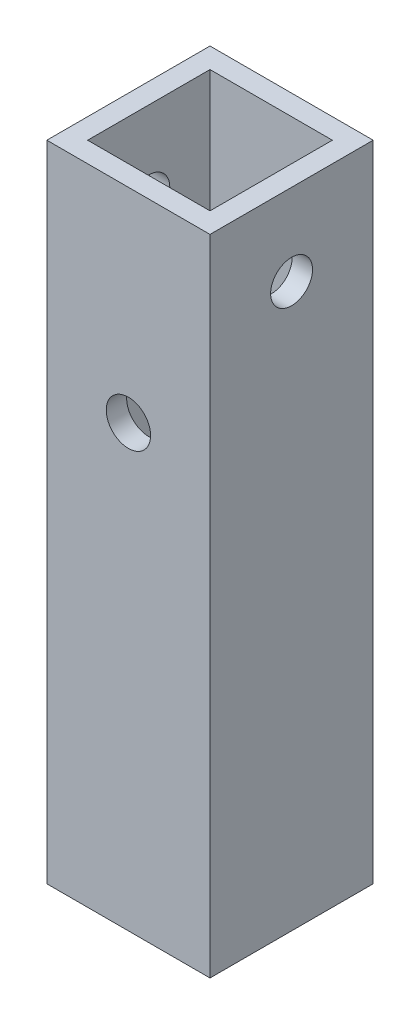
ISO-10303-21;
HEADER;
FILE_DESCRIPTION(('STEP AP214'),'2;1');
FILE_NAME('part.step','',(''),(''),'','','');
FILE_SCHEMA(('AUTOMOTIVE_DESIGN { 1 0 10303 214 1 1 1 1 }'));
ENDSEC;
DATA;
#1=APPLICATION_CONTEXT('core data for automotive mechanical design processes');
#2=APPLICATION_PROTOCOL_DEFINITION('international standard','automotive_design',2000,#1);
#3=PRODUCT_CONTEXT('',#1,'mechanical');
#4=PRODUCT('Part','Part','',(#3));
#5=PRODUCT_RELATED_PRODUCT_CATEGORY('part','',(#4));
#6=PRODUCT_DEFINITION_FORMATION('','',#4);
#7=PRODUCT_DEFINITION_CONTEXT('part definition',#1,'design');
#8=PRODUCT_DEFINITION('design','',#6,#7);
#9=PRODUCT_DEFINITION_SHAPE('','',#8);
#10=(LENGTH_UNIT() NAMED_UNIT(*) SI_UNIT(.MILLI.,.METRE.));
#11=(NAMED_UNIT(*) PLANE_ANGLE_UNIT() SI_UNIT($,.RADIAN.));
#12=(NAMED_UNIT(*) SI_UNIT($,.STERADIAN.) SOLID_ANGLE_UNIT());
#13=UNCERTAINTY_MEASURE_WITH_UNIT(LENGTH_MEASURE(1.E-05),#10,'distance_accuracy_value','');
#14=(GEOMETRIC_REPRESENTATION_CONTEXT(3) GLOBAL_UNCERTAINTY_ASSIGNED_CONTEXT((#13)) GLOBAL_UNIT_ASSIGNED_CONTEXT((#10,
#11,#12)) REPRESENTATION_CONTEXT('',''));
#15=CARTESIAN_POINT('',(0.,0.,0.));
#16=DIRECTION('',(0.,0.,1.));
#17=DIRECTION('',(1.,0.,0.));
#18=AXIS2_PLACEMENT_3D('',#15,#16,#17);
#19=CARTESIAN_POINT('',(0.,100.2538,0.));
#20=DIRECTION('',(0.,1.,0.));
#21=DIRECTION('',(0.,0.,1.));
#22=AXIS2_PLACEMENT_3D('',#19,#20,#21);
#23=PLANE('',#22);
#24=DIRECTION('',(0.,0.,1.));
#25=VECTOR('',#24,1.);
#26=CARTESIAN_POINT('',(-12.7,100.2538,12.7));
#27=LINE('',#26,#25);
#28=CARTESIAN_POINT('',(-12.7,100.2538,-12.7));
#29=VERTEX_POINT('',#28);
#30=CARTESIAN_POINT('',(-12.7,100.2538,12.7));
#31=VERTEX_POINT('',#30);
#32=EDGE_CURVE('E138',#29,#31,#27,.T.);
#33=ORIENTED_EDGE('',*,*,#32,.T.);
#34=DIRECTION('',(1.,0.,0.));
#35=VECTOR('',#34,1.);
#36=CARTESIAN_POINT('',(12.7,100.2538,12.7));
#37=LINE('',#36,#35);
#38=CARTESIAN_POINT('',(12.7,100.2538,12.7));
#39=VERTEX_POINT('',#38);
#40=EDGE_CURVE('E141',#31,#39,#37,.T.);
#41=ORIENTED_EDGE('',*,*,#40,.T.);
#42=DIRECTION('',(0.,0.,-1.));
#43=VECTOR('',#42,1.);
#44=CARTESIAN_POINT('',(12.7,100.2538,12.7));
#45=LINE('',#44,#43);
#46=CARTESIAN_POINT('',(12.7,100.2538,-12.7));
#47=VERTEX_POINT('',#46);
#48=EDGE_CURVE('E144',#39,#47,#45,.T.);
#49=ORIENTED_EDGE('',*,*,#48,.T.);
#50=DIRECTION('',(-1.,0.,0.));
#51=VECTOR('',#50,1.);
#52=CARTESIAN_POINT('',(12.7,100.2538,-12.7));
#53=LINE('',#52,#51);
#54=EDGE_CURVE('E146',#47,#29,#53,.T.);
#55=ORIENTED_EDGE('',*,*,#54,.T.);
#56=EDGE_LOOP('',(#33,#41,#49,#55));
#57=FACE_BOUND('',#56,.T.);
#58=DIRECTION('',(-1.,0.,0.));
#59=VECTOR('',#58,1.);
#60=CARTESIAN_POINT('',(9.525,100.2538,-9.525));
#61=LINE('',#60,#59);
#62=CARTESIAN_POINT('',(9.525,100.2538,-9.525));
#63=VERTEX_POINT('',#62);
#64=CARTESIAN_POINT('',(-9.525,100.2538,-9.525));
#65=VERTEX_POINT('',#64);
#66=EDGE_CURVE('E108',#63,#65,#61,.T.);
#67=ORIENTED_EDGE('',*,*,#66,.F.);
#68=DIRECTION('',(0.,0.,-1.));
#69=VECTOR('',#68,1.);
#70=CARTESIAN_POINT('',(9.525,100.2538,9.525));
#71=LINE('',#70,#69);
#72=CARTESIAN_POINT('',(9.525,100.2538,9.525));
#73=VERTEX_POINT('',#72);
#74=EDGE_CURVE('E100',#73,#63,#71,.T.);
#75=ORIENTED_EDGE('',*,*,#74,.F.);
#76=DIRECTION('',(1.,0.,0.));
#77=VECTOR('',#76,1.);
#78=CARTESIAN_POINT('',(9.525,100.2538,9.525));
#79=LINE('',#78,#77);
#80=CARTESIAN_POINT('',(-9.525,100.2538,9.525));
#81=VERTEX_POINT('',#80);
#82=EDGE_CURVE('E122',#81,#73,#79,.T.);
#83=ORIENTED_EDGE('',*,*,#82,.F.);
#84=DIRECTION('',(0.,0.,1.));
#85=VECTOR('',#84,1.);
#86=CARTESIAN_POINT('',(-9.525,100.2538,9.525));
#87=LINE('',#86,#85);
#88=EDGE_CURVE('E120',#65,#81,#87,.T.);
#89=ORIENTED_EDGE('',*,*,#88,.F.);
#90=EDGE_LOOP('',(#67,#75,#83,#89));
#91=FACE_BOUND('',#90,.T.);
#92=ADVANCED_FACE('F34',(#57,#91),#23,.T.);
#93=CARTESIAN_POINT('',(0.,0.,0.));
#94=DIRECTION('',(0.,1.,0.));
#95=DIRECTION('',(0.,0.,1.));
#96=AXIS2_PLACEMENT_3D('',#93,#94,#95);
#97=PLANE('',#96);
#98=DIRECTION('',(0.,0.,1.));
#99=VECTOR('',#98,1.);
#100=CARTESIAN_POINT('',(-12.7,0.,12.7));
#101=LINE('',#100,#99);
#102=CARTESIAN_POINT('',(-12.7,0.,-12.7));
#103=VERTEX_POINT('',#102);
#104=CARTESIAN_POINT('',(-12.7,0.,12.7));
#105=VERTEX_POINT('',#104);
#106=EDGE_CURVE('E116',#103,#105,#101,.T.);
#107=ORIENTED_EDGE('',*,*,#106,.F.);
#108=DIRECTION('',(-1.,0.,0.));
#109=VECTOR('',#108,1.);
#110=CARTESIAN_POINT('',(12.7,0.,-12.7));
#111=LINE('',#110,#109);
#112=CARTESIAN_POINT('',(12.7,0.,-12.7));
#113=VERTEX_POINT('',#112);
#114=EDGE_CURVE('E142',#113,#103,#111,.T.);
#115=ORIENTED_EDGE('',*,*,#114,.F.);
#116=DIRECTION('',(0.,0.,-1.));
#117=VECTOR('',#116,1.);
#118=CARTESIAN_POINT('',(12.7,0.,12.7));
#119=LINE('',#118,#117);
#120=CARTESIAN_POINT('',(12.7,0.,12.7));
#121=VERTEX_POINT('',#120);
#122=EDGE_CURVE('E153',#121,#113,#119,.T.);
#123=ORIENTED_EDGE('',*,*,#122,.F.);
#124=DIRECTION('',(1.,0.,0.));
#125=VECTOR('',#124,1.);
#126=CARTESIAN_POINT('',(12.7,0.,12.7));
#127=LINE('',#126,#125);
#128=EDGE_CURVE('E151',#105,#121,#127,.T.);
#129=ORIENTED_EDGE('',*,*,#128,.F.);
#130=EDGE_LOOP('',(#107,#115,#123,#129));
#131=FACE_BOUND('',#130,.T.);
#132=DIRECTION('',(0.,0.,-1.));
#133=VECTOR('',#132,1.);
#134=CARTESIAN_POINT('',(9.525,0.,9.525));
#135=LINE('',#134,#133);
#136=CARTESIAN_POINT('',(9.525,0.,9.525));
#137=VERTEX_POINT('',#136);
#138=CARTESIAN_POINT('',(9.525,0.,-9.525));
#139=VERTEX_POINT('',#138);
#140=EDGE_CURVE('E58',#137,#139,#135,.T.);
#141=ORIENTED_EDGE('',*,*,#140,.T.);
#142=DIRECTION('',(-1.,0.,0.));
#143=VECTOR('',#142,1.);
#144=CARTESIAN_POINT('',(9.525,0.,-9.525));
#145=LINE('',#144,#143);
#146=CARTESIAN_POINT('',(-9.525,0.,-9.525));
#147=VERTEX_POINT('',#146);
#148=EDGE_CURVE('E115',#139,#147,#145,.T.);
#149=ORIENTED_EDGE('',*,*,#148,.T.);
#150=DIRECTION('',(0.,0.,1.));
#151=VECTOR('',#150,1.);
#152=CARTESIAN_POINT('',(-9.525,0.,9.525));
#153=LINE('',#152,#151);
#154=CARTESIAN_POINT('',(-9.525,0.,9.525));
#155=VERTEX_POINT('',#154);
#156=EDGE_CURVE('E130',#147,#155,#153,.T.);
#157=ORIENTED_EDGE('',*,*,#156,.T.);
#158=DIRECTION('',(1.,0.,0.));
#159=VECTOR('',#158,1.);
#160=CARTESIAN_POINT('',(9.525,0.,9.525));
#161=LINE('',#160,#159);
#162=EDGE_CURVE('E109',#155,#137,#161,.T.);
#163=ORIENTED_EDGE('',*,*,#162,.T.);
#164=EDGE_LOOP('',(#141,#149,#157,#163));
#165=FACE_BOUND('',#164,.T.);
#166=ADVANCED_FACE('F172',(#131,#165),#97,.F.);
#167=CARTESIAN_POINT('',(-12.7,100.2538,12.7));
#168=DIRECTION('',(1.,0.,0.));
#169=DIRECTION('',(0.,0.,-1.));
#170=AXIS2_PLACEMENT_3D('',#167,#168,#169);
#171=PLANE('',#170);
#172=CARTESIAN_POINT('',(-12.7,87.5538,0.));
#173=DIRECTION('',(1.,0.,0.));
#174=DIRECTION('',(0.,0.,-1.));
#175=AXIS2_PLACEMENT_3D('',#172,#173,#174);
#176=CIRCLE('',#175,3.26389999999999);
#177=CARTESIAN_POINT('',(-12.7,87.5538,-3.26389999999999));
#178=VERTEX_POINT('',#177);
#179=EDGE_CURVE('E226',#178,#178,#176,.T.);
#180=ORIENTED_EDGE('',*,*,#179,.T.);
#181=EDGE_LOOP('',(#180));
#182=FACE_BOUND('',#181,.T.);
#183=ORIENTED_EDGE('',*,*,#106,.T.);
#184=DIRECTION('',(0.,-1.,0.));
#185=VECTOR('',#184,1.);
#186=CARTESIAN_POINT('',(-12.7,100.2538,12.7));
#187=LINE('',#186,#185);
#188=EDGE_CURVE('E11',#31,#105,#187,.T.);
#189=ORIENTED_EDGE('',*,*,#188,.F.);
#190=ORIENTED_EDGE('',*,*,#32,.F.);
#191=DIRECTION('',(0.,-1.,0.));
#192=VECTOR('',#191,1.);
#193=CARTESIAN_POINT('',(-12.7,100.2538,-12.7));
#194=LINE('',#193,#192);
#195=EDGE_CURVE('E148',#29,#103,#194,.T.);
#196=ORIENTED_EDGE('',*,*,#195,.T.);
#197=EDGE_LOOP('',(#183,#189,#190,#196));
#198=FACE_BOUND('',#197,.T.);
#199=ADVANCED_FACE('F36',(#182,#198),#171,.F.);
#200=CARTESIAN_POINT('',(12.7,100.2538,12.7));
#201=DIRECTION('',(0.,0.,-1.));
#202=DIRECTION('',(-1.,0.,0.));
#203=AXIS2_PLACEMENT_3D('',#200,#201,#202);
#204=PLANE('',#203);
#205=CARTESIAN_POINT('',(0.,68.5038,12.7));
#206=DIRECTION('',(0.,0.,1.));
#207=DIRECTION('',(1.,0.,0.));
#208=AXIS2_PLACEMENT_3D('',#205,#206,#207);
#209=CIRCLE('',#208,3.4544);
#210=CARTESIAN_POINT('',(3.4544,68.5038,12.7));
#211=VERTEX_POINT('',#210);
#212=EDGE_CURVE('E213',#211,#211,#209,.T.);
#213=ORIENTED_EDGE('',*,*,#212,.F.);
#214=EDGE_LOOP('',(#213));
#215=FACE_BOUND('',#214,.T.);
#216=ORIENTED_EDGE('',*,*,#128,.T.);
#217=DIRECTION('',(0.,-1.,0.));
#218=VECTOR('',#217,1.);
#219=CARTESIAN_POINT('',(12.7,100.2538,12.7));
#220=LINE('',#219,#218);
#221=EDGE_CURVE('E43',#39,#121,#220,.T.);
#222=ORIENTED_EDGE('',*,*,#221,.F.);
#223=ORIENTED_EDGE('',*,*,#40,.F.);
#224=ORIENTED_EDGE('',*,*,#188,.T.);
#225=EDGE_LOOP('',(#216,#222,#223,#224));
#226=FACE_BOUND('',#225,.T.);
#227=ADVANCED_FACE('F182',(#215,#226),#204,.F.);
#228=CARTESIAN_POINT('',(12.7,100.2538,12.7));
#229=DIRECTION('',(-1.,0.,0.));
#230=DIRECTION('',(0.,0.,1.));
#231=AXIS2_PLACEMENT_3D('',#228,#229,#230);
#232=PLANE('',#231);
#233=CARTESIAN_POINT('',(12.7,87.5538,0.));
#234=DIRECTION('',(1.,0.,0.));
#235=DIRECTION('',(0.,0.,-1.));
#236=AXIS2_PLACEMENT_3D('',#233,#234,#235);
#237=CIRCLE('',#236,3.26389999999999);
#238=CARTESIAN_POINT('',(12.7,87.5538,-3.26389999999999));
#239=VERTEX_POINT('',#238);
#240=EDGE_CURVE('E223',#239,#239,#237,.T.);
#241=ORIENTED_EDGE('',*,*,#240,.F.);
#242=EDGE_LOOP('',(#241));
#243=FACE_BOUND('',#242,.T.);
#244=ORIENTED_EDGE('',*,*,#122,.T.);
#245=DIRECTION('',(0.,-1.,0.));
#246=VECTOR('',#245,1.);
#247=CARTESIAN_POINT('',(12.7,100.2538,-12.7));
#248=LINE('',#247,#246);
#249=EDGE_CURVE('E158',#47,#113,#248,.T.);
#250=ORIENTED_EDGE('',*,*,#249,.F.);
#251=ORIENTED_EDGE('',*,*,#48,.F.);
#252=ORIENTED_EDGE('',*,*,#221,.T.);
#253=EDGE_LOOP('',(#244,#250,#251,#252));
#254=FACE_BOUND('',#253,.T.);
#255=ADVANCED_FACE('F166',(#243,#254),#232,.F.);
#256=CARTESIAN_POINT('',(12.7,100.2538,-12.7));
#257=DIRECTION('',(0.,0.,1.));
#258=DIRECTION('',(1.,0.,0.));
#259=AXIS2_PLACEMENT_3D('',#256,#257,#258);
#260=PLANE('',#259);
#261=CARTESIAN_POINT('',(0.,68.5038,-12.7));
#262=DIRECTION('',(0.,0.,1.));
#263=DIRECTION('',(1.,0.,0.));
#264=AXIS2_PLACEMENT_3D('',#261,#262,#263);
#265=CIRCLE('',#264,3.45439999999999);
#266=CARTESIAN_POINT('',(3.4544,68.5038,-12.7));
#267=VERTEX_POINT('',#266);
#268=EDGE_CURVE('E210',#267,#267,#265,.T.);
#269=ORIENTED_EDGE('',*,*,#268,.T.);
#270=EDGE_LOOP('',(#269));
#271=FACE_BOUND('',#270,.T.);
#272=ORIENTED_EDGE('',*,*,#114,.T.);
#273=ORIENTED_EDGE('',*,*,#195,.F.);
#274=ORIENTED_EDGE('',*,*,#54,.F.);
#275=ORIENTED_EDGE('',*,*,#249,.T.);
#276=EDGE_LOOP('',(#272,#273,#274,#275));
#277=FACE_BOUND('',#276,.T.);
#278=ADVANCED_FACE('F176',(#271,#277),#260,.F.);
#279=CARTESIAN_POINT('',(9.525,100.2538,9.525));
#280=DIRECTION('',(-1.,0.,0.));
#281=DIRECTION('',(0.,0.,1.));
#282=AXIS2_PLACEMENT_3D('',#279,#280,#281);
#283=PLANE('',#282);
#284=CARTESIAN_POINT('',(9.525,87.5538,0.));
#285=DIRECTION('',(-1.,0.,0.));
#286=DIRECTION('',(0.,0.,1.));
#287=AXIS2_PLACEMENT_3D('',#284,#285,#286);
#288=CIRCLE('',#287,3.26389999999999);
#289=CARTESIAN_POINT('',(9.525,87.5538,3.26389999999999));
#290=VERTEX_POINT('',#289);
#291=EDGE_CURVE('E38',#290,#290,#288,.T.);
#292=ORIENTED_EDGE('',*,*,#291,.F.);
#293=EDGE_LOOP('',(#292));
#294=FACE_BOUND('',#293,.T.);
#295=ORIENTED_EDGE('',*,*,#140,.F.);
#296=DIRECTION('',(0.,-1.,0.));
#297=VECTOR('',#296,1.);
#298=CARTESIAN_POINT('',(9.525,100.2538,9.525));
#299=LINE('',#298,#297);
#300=EDGE_CURVE('E104',#73,#137,#299,.T.);
#301=ORIENTED_EDGE('',*,*,#300,.F.);
#302=ORIENTED_EDGE('',*,*,#74,.T.);
#303=DIRECTION('',(0.,-1.,0.));
#304=VECTOR('',#303,1.);
#305=CARTESIAN_POINT('',(9.525,100.2538,-9.525));
#306=LINE('',#305,#304);
#307=EDGE_CURVE('E103',#63,#139,#306,.T.);
#308=ORIENTED_EDGE('',*,*,#307,.T.);
#309=EDGE_LOOP('',(#295,#301,#302,#308));
#310=FACE_BOUND('',#309,.T.);
#311=ADVANCED_FACE('F102',(#294,#310),#283,.T.);
#312=CARTESIAN_POINT('',(9.525,100.2538,-9.525));
#313=DIRECTION('',(0.,0.,1.));
#314=DIRECTION('',(1.,0.,0.));
#315=AXIS2_PLACEMENT_3D('',#312,#313,#314);
#316=PLANE('',#315);
#317=CARTESIAN_POINT('',(0.,68.5038,-9.525));
#318=DIRECTION('',(0.,0.,1.));
#319=DIRECTION('',(1.,0.,0.));
#320=AXIS2_PLACEMENT_3D('',#317,#318,#319);
#321=CIRCLE('',#320,3.4544);
#322=CARTESIAN_POINT('',(3.4544,68.5038,-9.525));
#323=VERTEX_POINT('',#322);
#324=EDGE_CURVE('E212',#323,#323,#321,.T.);
#325=ORIENTED_EDGE('',*,*,#324,.F.);
#326=EDGE_LOOP('',(#325));
#327=FACE_BOUND('',#326,.T.);
#328=ORIENTED_EDGE('',*,*,#148,.F.);
#329=ORIENTED_EDGE('',*,*,#307,.F.);
#330=ORIENTED_EDGE('',*,*,#66,.T.);
#331=DIRECTION('',(0.,-1.,0.));
#332=VECTOR('',#331,1.);
#333=CARTESIAN_POINT('',(-9.525,100.2538,-9.525));
#334=LINE('',#333,#332);
#335=EDGE_CURVE('E117',#65,#147,#334,.T.);
#336=ORIENTED_EDGE('',*,*,#335,.T.);
#337=EDGE_LOOP('',(#328,#329,#330,#336));
#338=FACE_BOUND('',#337,.T.);
#339=ADVANCED_FACE('F112',(#327,#338),#316,.T.);
#340=CARTESIAN_POINT('',(-9.525,100.2538,9.525));
#341=DIRECTION('',(1.,0.,0.));
#342=DIRECTION('',(0.,0.,-1.));
#343=AXIS2_PLACEMENT_3D('',#340,#341,#342);
#344=PLANE('',#343);
#345=CARTESIAN_POINT('',(-9.525,87.5538,0.));
#346=DIRECTION('',(1.,0.,0.));
#347=DIRECTION('',(0.,0.,-1.));
#348=AXIS2_PLACEMENT_3D('',#345,#346,#347);
#349=CIRCLE('',#348,3.26389999999999);
#350=CARTESIAN_POINT('',(-9.525,87.5538,-3.26389999999999));
#351=VERTEX_POINT('',#350);
#352=EDGE_CURVE('E128',#351,#351,#349,.T.);
#353=ORIENTED_EDGE('',*,*,#352,.F.);
#354=EDGE_LOOP('',(#353));
#355=FACE_BOUND('',#354,.T.);
#356=ORIENTED_EDGE('',*,*,#156,.F.);
#357=ORIENTED_EDGE('',*,*,#335,.F.);
#358=ORIENTED_EDGE('',*,*,#88,.T.);
#359=DIRECTION('',(0.,-1.,0.));
#360=VECTOR('',#359,1.);
#361=CARTESIAN_POINT('',(-9.525,100.2538,9.525));
#362=LINE('',#361,#360);
#363=EDGE_CURVE('E50',#81,#155,#362,.T.);
#364=ORIENTED_EDGE('',*,*,#363,.T.);
#365=EDGE_LOOP('',(#356,#357,#358,#364));
#366=FACE_BOUND('',#365,.T.);
#367=ADVANCED_FACE('F246',(#355,#366),#344,.T.);
#368=CARTESIAN_POINT('',(9.525,100.2538,9.525));
#369=DIRECTION('',(0.,0.,-1.));
#370=DIRECTION('',(-1.,0.,0.));
#371=AXIS2_PLACEMENT_3D('',#368,#369,#370);
#372=PLANE('',#371);
#373=CARTESIAN_POINT('',(0.,68.5038,9.525));
#374=DIRECTION('',(0.,0.,-1.));
#375=DIRECTION('',(-1.,0.,0.));
#376=AXIS2_PLACEMENT_3D('',#373,#374,#375);
#377=CIRCLE('',#376,3.4544);
#378=CARTESIAN_POINT('',(-3.45439999999999,68.5038,9.525));
#379=VERTEX_POINT('',#378);
#380=EDGE_CURVE('E216',#379,#379,#377,.T.);
#381=ORIENTED_EDGE('',*,*,#380,.F.);
#382=EDGE_LOOP('',(#381));
#383=FACE_BOUND('',#382,.T.);
#384=ORIENTED_EDGE('',*,*,#162,.F.);
#385=ORIENTED_EDGE('',*,*,#363,.F.);
#386=ORIENTED_EDGE('',*,*,#82,.T.);
#387=ORIENTED_EDGE('',*,*,#300,.T.);
#388=EDGE_LOOP('',(#384,#385,#386,#387));
#389=FACE_BOUND('',#388,.T.);
#390=ADVANCED_FACE('F238',(#383,#389),#372,.T.);
#391=CARTESIAN_POINT('',(12.7,87.5538,0.));
#392=DIRECTION('',(1.,0.,0.));
#393=DIRECTION('',(0.,0.,-1.));
#394=AXIS2_PLACEMENT_3D('',#391,#392,#393);
#395=CYLINDRICAL_SURFACE('',#394,3.26389999999999);
#396=ORIENTED_EDGE('',*,*,#291,.T.);
#397=EDGE_LOOP('',(#396));
#398=FACE_BOUND('',#397,.T.);
#399=ORIENTED_EDGE('',*,*,#240,.T.);
#400=EDGE_LOOP('',(#399));
#401=FACE_BOUND('',#400,.T.);
#402=ADVANCED_FACE('F234',(#398,#401),#395,.F.);
#403=ORIENTED_EDGE('',*,*,#352,.T.);
#404=EDGE_LOOP('',(#403));
#405=FACE_BOUND('',#404,.T.);
#406=ORIENTED_EDGE('',*,*,#179,.F.);
#407=EDGE_LOOP('',(#406));
#408=FACE_BOUND('',#407,.T.);
#409=ADVANCED_FACE('F237',(#405,#408),#395,.F.);
#410=CARTESIAN_POINT('',(0.,68.5038,12.7));
#411=DIRECTION('',(0.,0.,1.));
#412=DIRECTION('',(1.,0.,0.));
#413=AXIS2_PLACEMENT_3D('',#410,#411,#412);
#414=CYLINDRICAL_SURFACE('',#413,3.4544);
#415=ORIENTED_EDGE('',*,*,#324,.T.);
#416=EDGE_LOOP('',(#415));
#417=FACE_BOUND('',#416,.T.);
#418=ORIENTED_EDGE('',*,*,#268,.F.);
#419=EDGE_LOOP('',(#418));
#420=FACE_BOUND('',#419,.T.);
#421=ADVANCED_FACE('F245',(#417,#420),#414,.F.);
#422=ORIENTED_EDGE('',*,*,#380,.T.);
#423=EDGE_LOOP('',(#422));
#424=FACE_BOUND('',#423,.T.);
#425=ORIENTED_EDGE('',*,*,#212,.T.);
#426=EDGE_LOOP('',(#425));
#427=FACE_BOUND('',#426,.T.);
#428=ADVANCED_FACE('F260',(#424,#427),#414,.F.);
#429=CLOSED_SHELL('',(#92,#166,#199,#227,#255,#278,#311,#339,#367,#390,#402,#409,#421,#428));
#430=MANIFOLD_SOLID_BREP('B2',#429);
#431=ADVANCED_BREP_SHAPE_REPRESENTATION('',(#18,#430),#14);
#432=SHAPE_DEFINITION_REPRESENTATION(#9,#431);
ENDSEC;
END-ISO-10303-21;
